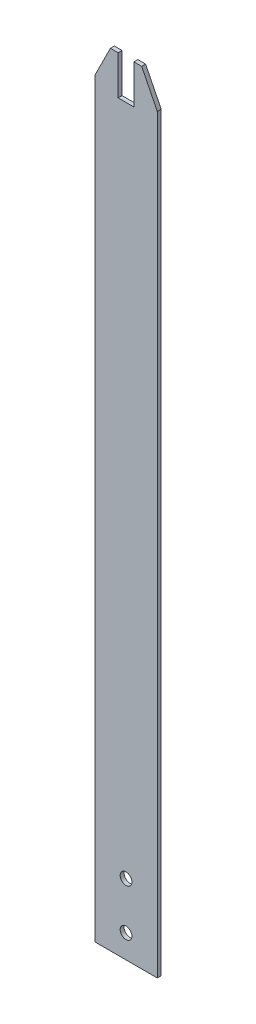
ISO-10303-21;
HEADER;
FILE_DESCRIPTION(('STEP AP214'),'2;1');
FILE_NAME('part.step','',(''),(''),'','','');
FILE_SCHEMA(('AUTOMOTIVE_DESIGN { 1 0 10303 214 1 1 1 1 }'));
ENDSEC;
DATA;
#1=APPLICATION_CONTEXT('core data for automotive mechanical design processes');
#2=APPLICATION_PROTOCOL_DEFINITION('international standard','automotive_design',2000,#1);
#3=PRODUCT_CONTEXT('',#1,'mechanical');
#4=PRODUCT('Part','Part','',(#3));
#5=PRODUCT_RELATED_PRODUCT_CATEGORY('part','',(#4));
#6=PRODUCT_DEFINITION_FORMATION('','',#4);
#7=PRODUCT_DEFINITION_CONTEXT('part definition',#1,'design');
#8=PRODUCT_DEFINITION('design','',#6,#7);
#9=PRODUCT_DEFINITION_SHAPE('','',#8);
#10=(LENGTH_UNIT() NAMED_UNIT(*) SI_UNIT(.MILLI.,.METRE.));
#11=(NAMED_UNIT(*) PLANE_ANGLE_UNIT() SI_UNIT($,.RADIAN.));
#12=(NAMED_UNIT(*) SI_UNIT($,.STERADIAN.) SOLID_ANGLE_UNIT());
#13=UNCERTAINTY_MEASURE_WITH_UNIT(LENGTH_MEASURE(1.E-05),#10,'distance_accuracy_value','');
#14=(GEOMETRIC_REPRESENTATION_CONTEXT(3) GLOBAL_UNCERTAINTY_ASSIGNED_CONTEXT((#13)) GLOBAL_UNIT_ASSIGNED_CONTEXT((#10,
#11,#12)) REPRESENTATION_CONTEXT('',''));
#15=CARTESIAN_POINT('',(0.,0.,0.));
#16=DIRECTION('',(0.,0.,1.));
#17=DIRECTION('',(1.,0.,0.));
#18=AXIS2_PLACEMENT_3D('',#15,#16,#17);
#19=CARTESIAN_POINT('',(1.15525786010828E-13,-1000.,2.5));
#20=DIRECTION('',(0.,0.,-1.));
#21=DIRECTION('',(-1.,0.,0.));
#22=AXIS2_PLACEMENT_3D('',#19,#20,#21);
#23=PLANE('',#22);
#24=CARTESIAN_POINT('',(-39.9999999999999,-970.,2.5));
#25=DIRECTION('',(0.,0.,1.));
#26=DIRECTION('',(1.,0.,0.));
#27=AXIS2_PLACEMENT_3D('',#24,#25,#26);
#28=CIRCLE('',#27,7.5);
#29=CARTESIAN_POINT('',(-32.4999999999999,-970.,2.5));
#30=VERTEX_POINT('',#29);
#31=EDGE_CURVE('E157',#30,#30,#28,.T.);
#32=ORIENTED_EDGE('',*,*,#31,.F.);
#33=EDGE_LOOP('',(#32));
#34=FACE_BOUND('',#33,.T.);
#35=CARTESIAN_POINT('',(-39.9999999999999,-910.,2.5));
#36=DIRECTION('',(0.,0.,1.));
#37=DIRECTION('',(1.,0.,0.));
#38=AXIS2_PLACEMENT_3D('',#35,#36,#37);
#39=CIRCLE('',#38,7.5);
#40=CARTESIAN_POINT('',(-32.4999999999999,-910.,2.5));
#41=VERTEX_POINT('',#40);
#42=EDGE_CURVE('E169',#41,#41,#39,.T.);
#43=ORIENTED_EDGE('',*,*,#42,.F.);
#44=EDGE_LOOP('',(#43));
#45=FACE_BOUND('',#44,.T.);
#46=DIRECTION('',(-0.447213595499958,-0.894427190999916,0.));
#47=VECTOR('',#46,1.);
#48=CARTESIAN_POINT('',(-48.,24.,2.5));
#49=LINE('',#48,#47);
#50=CARTESIAN_POINT('',(-60.,0.,2.49999999999979));
#51=VERTEX_POINT('',#50);
#52=CARTESIAN_POINT('',(-80.,-40.,2.5));
#53=VERTEX_POINT('',#52);
#54=EDGE_CURVE('E51',#51,#53,#49,.T.);
#55=ORIENTED_EDGE('',*,*,#54,.T.);
#56=DIRECTION('',(0.,1.,0.));
#57=VECTOR('',#56,1.);
#58=CARTESIAN_POINT('',(-79.9999999999999,-1000.,2.49999999999972));
#59=LINE('',#58,#57);
#60=CARTESIAN_POINT('',(-79.9999999999999,-1000.,2.49999999999972));
#61=VERTEX_POINT('',#60);
#62=EDGE_CURVE('E123',#61,#53,#59,.T.);
#63=ORIENTED_EDGE('',*,*,#62,.F.);
#64=DIRECTION('',(-1.,0.,0.));
#65=VECTOR('',#64,1.);
#66=CARTESIAN_POINT('',(1.15525786010828E-13,-1000.,2.5));
#67=LINE('',#66,#65);
#68=CARTESIAN_POINT('',(1.15525786010828E-13,-1000.,2.5));
#69=VERTEX_POINT('',#68);
#70=EDGE_CURVE('E178',#69,#61,#67,.T.);
#71=ORIENTED_EDGE('',*,*,#70,.F.);
#72=DIRECTION('',(0.,1.,0.));
#73=VECTOR('',#72,1.);
#74=CARTESIAN_POINT('',(1.15525786010828E-13,-1000.,2.5));
#75=LINE('',#74,#73);
#76=CARTESIAN_POINT('',(-1.26689023854931E-13,-40.,2.5));
#77=VERTEX_POINT('',#76);
#78=EDGE_CURVE('E132',#69,#77,#75,.T.);
#79=ORIENTED_EDGE('',*,*,#78,.T.);
#80=DIRECTION('',(0.447213595499956,-0.894427190999917,0.));
#81=VECTOR('',#80,1.);
#82=CARTESIAN_POINT('',(-20.,0.,2.5));
#83=LINE('',#82,#81);
#84=CARTESIAN_POINT('',(-20.,0.,2.5));
#85=VERTEX_POINT('',#84);
#86=EDGE_CURVE('E198',#85,#77,#83,.T.);
#87=ORIENTED_EDGE('',*,*,#86,.F.);
#88=DIRECTION('',(-1.,0.,0.));
#89=VECTOR('',#88,1.);
#90=CARTESIAN_POINT('',(0.,0.,2.5));
#91=LINE('',#90,#89);
#92=CARTESIAN_POINT('',(-29.9,0.,2.5));
#93=VERTEX_POINT('',#92);
#94=EDGE_CURVE('E184',#85,#93,#91,.T.);
#95=ORIENTED_EDGE('',*,*,#94,.T.);
#96=DIRECTION('',(0.,-1.,0.));
#97=VECTOR('',#96,1.);
#98=CARTESIAN_POINT('',(-29.9,0.,2.5));
#99=LINE('',#98,#97);
#100=CARTESIAN_POINT('',(-29.9,-50.,2.5));
#101=VERTEX_POINT('',#100);
#102=EDGE_CURVE('E128',#93,#101,#99,.T.);
#103=ORIENTED_EDGE('',*,*,#102,.T.);
#104=DIRECTION('',(1.,0.,0.));
#105=VECTOR('',#104,1.);
#106=CARTESIAN_POINT('',(-50.1,-50.,2.5));
#107=LINE('',#106,#105);
#108=CARTESIAN_POINT('',(-50.1,-50.,2.5));
#109=VERTEX_POINT('',#108);
#110=EDGE_CURVE('E204',#109,#101,#107,.T.);
#111=ORIENTED_EDGE('',*,*,#110,.F.);
#112=DIRECTION('',(0.,1.,0.));
#113=VECTOR('',#112,1.);
#114=CARTESIAN_POINT('',(-50.1,-50.,2.5));
#115=LINE('',#114,#113);
#116=CARTESIAN_POINT('',(-50.1,0.,2.5));
#117=VERTEX_POINT('',#116);
#118=EDGE_CURVE('E207',#109,#117,#115,.T.);
#119=ORIENTED_EDGE('',*,*,#118,.T.);
#120=EDGE_CURVE('E127',#117,#51,#91,.T.);
#121=ORIENTED_EDGE('',*,*,#120,.T.);
#122=EDGE_LOOP('',(#55,#63,#71,#79,#87,#95,#103,#111,#119,#121));
#123=FACE_BOUND('',#122,.T.);
#124=ADVANCED_FACE('F36',(#34,#45,#123),#23,.F.);
#125=CARTESIAN_POINT('',(-79.9999999999999,-1000.,-2.50000000000028));
#126=DIRECTION('',(1.,0.,0.));
#127=DIRECTION('',(0.,0.,-1.));
#128=AXIS2_PLACEMENT_3D('',#125,#126,#127);
#129=PLANE('',#128);
#130=DIRECTION('',(0.,0.,1.));
#131=VECTOR('',#130,1.);
#132=CARTESIAN_POINT('',(-80.,-40.,-20.0000000000002));
#133=LINE('',#132,#131);
#134=CARTESIAN_POINT('',(-80.,-40.,-2.50000000000028));
#135=VERTEX_POINT('',#134);
#136=EDGE_CURVE('E111',#135,#53,#133,.T.);
#137=ORIENTED_EDGE('',*,*,#136,.F.);
#138=DIRECTION('',(0.,1.,0.));
#139=VECTOR('',#138,1.);
#140=CARTESIAN_POINT('',(-79.9999999999999,-1000.,-2.50000000000028));
#141=LINE('',#140,#139);
#142=CARTESIAN_POINT('',(-79.9999999999999,-1000.,-2.50000000000028));
#143=VERTEX_POINT('',#142);
#144=EDGE_CURVE('E133',#143,#135,#141,.T.);
#145=ORIENTED_EDGE('',*,*,#144,.F.);
#146=DIRECTION('',(0.,0.,-1.));
#147=VECTOR('',#146,1.);
#148=CARTESIAN_POINT('',(-79.9999999999999,-1000.,-2.50000000000028));
#149=LINE('',#148,#147);
#150=EDGE_CURVE('E131',#61,#143,#149,.T.);
#151=ORIENTED_EDGE('',*,*,#150,.F.);
#152=ORIENTED_EDGE('',*,*,#62,.T.);
#153=EDGE_LOOP('',(#137,#145,#151,#152));
#154=FACE_BOUND('',#153,.T.);
#155=ADVANCED_FACE('F130',(#154),#129,.F.);
#156=CARTESIAN_POINT('',(1.29403573818643E-13,-1000.,-2.5));
#157=DIRECTION('',(0.,0.,1.));
#158=DIRECTION('',(1.,0.,0.));
#159=AXIS2_PLACEMENT_3D('',#156,#157,#158);
#160=PLANE('',#159);
#161=CARTESIAN_POINT('',(-39.9999999999999,-970.,-2.50000000000028));
#162=DIRECTION('',(0.,0.,1.));
#163=DIRECTION('',(1.,0.,0.));
#164=AXIS2_PLACEMENT_3D('',#161,#162,#163);
#165=CIRCLE('',#164,7.5);
#166=CARTESIAN_POINT('',(-32.4999999999999,-970.,-2.50000000000028));
#167=VERTEX_POINT('',#166);
#168=EDGE_CURVE('E161',#167,#167,#165,.T.);
#169=ORIENTED_EDGE('',*,*,#168,.T.);
#170=EDGE_LOOP('',(#169));
#171=FACE_BOUND('',#170,.T.);
#172=CARTESIAN_POINT('',(-39.9999999999999,-910.,-2.50000000000028));
#173=DIRECTION('',(0.,0.,1.));
#174=DIRECTION('',(1.,0.,0.));
#175=AXIS2_PLACEMENT_3D('',#172,#173,#174);
#176=CIRCLE('',#175,7.5);
#177=CARTESIAN_POINT('',(-32.4999999999999,-910.,-2.50000000000028));
#178=VERTEX_POINT('',#177);
#179=EDGE_CURVE('E172',#178,#178,#176,.T.);
#180=ORIENTED_EDGE('',*,*,#179,.T.);
#181=EDGE_LOOP('',(#180));
#182=FACE_BOUND('',#181,.T.);
#183=DIRECTION('',(-0.447213595499958,-0.894427190999916,0.));
#184=VECTOR('',#183,1.);
#185=CARTESIAN_POINT('',(-448.,-776.,-2.50000000000156));
#186=LINE('',#185,#184);
#187=CARTESIAN_POINT('',(-60.,0.,-2.50000000000028));
#188=VERTEX_POINT('',#187);
#189=EDGE_CURVE('E114',#188,#135,#186,.T.);
#190=ORIENTED_EDGE('',*,*,#189,.F.);
#191=DIRECTION('',(1.,0.,0.));
#192=VECTOR('',#191,1.);
#193=CARTESIAN_POINT('',(0.,0.,-2.5));
#194=LINE('',#193,#192);
#195=CARTESIAN_POINT('',(-50.1,0.,-2.50000000000017));
#196=VERTEX_POINT('',#195);
#197=EDGE_CURVE('E152',#188,#196,#194,.T.);
#198=ORIENTED_EDGE('',*,*,#197,.T.);
#199=DIRECTION('',(0.,1.,0.));
#200=VECTOR('',#199,1.);
#201=CARTESIAN_POINT('',(-50.1,-1000.,-2.50000000000017));
#202=LINE('',#201,#200);
#203=CARTESIAN_POINT('',(-50.1,-50.,-2.50000000000017));
#204=VERTEX_POINT('',#203);
#205=EDGE_CURVE('E163',#204,#196,#202,.T.);
#206=ORIENTED_EDGE('',*,*,#205,.F.);
#207=DIRECTION('',(1.,0.,0.));
#208=VECTOR('',#207,1.);
#209=CARTESIAN_POINT('',(1.29403573818643E-13,-50.,-2.5));
#210=LINE('',#209,#208);
#211=CARTESIAN_POINT('',(-29.9,-50.,-2.50000000000014));
#212=VERTEX_POINT('',#211);
#213=EDGE_CURVE('E11',#204,#212,#210,.T.);
#214=ORIENTED_EDGE('',*,*,#213,.T.);
#215=DIRECTION('',(0.,-1.,0.));
#216=VECTOR('',#215,1.);
#217=CARTESIAN_POINT('',(-29.8999999999999,-1000.,-2.5000000000001));
#218=LINE('',#217,#216);
#219=CARTESIAN_POINT('',(-29.9,0.,-2.50000000000028));
#220=VERTEX_POINT('',#219);
#221=EDGE_CURVE('E158',#220,#212,#218,.T.);
#222=ORIENTED_EDGE('',*,*,#221,.F.);
#223=CARTESIAN_POINT('',(-20.,0.,-2.50000000000007));
#224=VERTEX_POINT('',#223);
#225=EDGE_CURVE('E185',#220,#224,#194,.T.);
#226=ORIENTED_EDGE('',*,*,#225,.T.);
#227=DIRECTION('',(0.447213595499955,-0.894427190999917,0.));
#228=VECTOR('',#227,1.);
#229=CARTESIAN_POINT('',(383.999999999998,-808.000000000002,-2.49999999999866));
#230=LINE('',#229,#228);
#231=CARTESIAN_POINT('',(-1.26689023854931E-13,-40.,-2.50000000000003));
#232=VERTEX_POINT('',#231);
#233=EDGE_CURVE('E59',#224,#232,#230,.T.);
#234=ORIENTED_EDGE('',*,*,#233,.T.);
#235=DIRECTION('',(0.,1.,0.));
#236=VECTOR('',#235,1.);
#237=CARTESIAN_POINT('',(1.29403573818643E-13,-1000.,-2.5));
#238=LINE('',#237,#236);
#239=CARTESIAN_POINT('',(1.29403573818643E-13,-1000.,-2.5));
#240=VERTEX_POINT('',#239);
#241=EDGE_CURVE('E138',#240,#232,#238,.T.);
#242=ORIENTED_EDGE('',*,*,#241,.F.);
#243=DIRECTION('',(1.,0.,0.));
#244=VECTOR('',#243,1.);
#245=CARTESIAN_POINT('',(1.29403573818643E-13,-1000.,-2.5));
#246=LINE('',#245,#244);
#247=EDGE_CURVE('E181',#143,#240,#246,.T.);
#248=ORIENTED_EDGE('',*,*,#247,.F.);
#249=ORIENTED_EDGE('',*,*,#144,.T.);
#250=EDGE_LOOP('',(#190,#198,#206,#214,#222,#226,#234,#242,#248,#249));
#251=FACE_BOUND('',#250,.T.);
#252=ADVANCED_FACE('F154',(#171,#182,#251),#160,.F.);
#253=CARTESIAN_POINT('',(-40.,0.,-1.38777878078145E-13));
#254=DIRECTION('',(0.,1.,0.));
#255=DIRECTION('',(-1.,0.,0.));
#256=AXIS2_PLACEMENT_3D('',#253,#254,#255);
#257=PLANE('',#256);
#258=ORIENTED_EDGE('',*,*,#197,.F.);
#259=DIRECTION('',(0.,0.,1.));
#260=VECTOR('',#259,1.);
#261=CARTESIAN_POINT('',(-60.,0.,-1.38777878078145E-13));
#262=LINE('',#261,#260);
#263=EDGE_CURVE('E44',#188,#51,#262,.T.);
#264=ORIENTED_EDGE('',*,*,#263,.T.);
#265=ORIENTED_EDGE('',*,*,#120,.F.);
#266=DIRECTION('',(0.,0.,-1.));
#267=VECTOR('',#266,1.);
#268=CARTESIAN_POINT('',(-50.1,0.,-1.38777878078145E-13));
#269=LINE('',#268,#267);
#270=EDGE_CURVE('E143',#117,#196,#269,.T.);
#271=ORIENTED_EDGE('',*,*,#270,.T.);
#272=EDGE_LOOP('',(#258,#264,#265,#271));
#273=FACE_BOUND('',#272,.T.);
#274=ADVANCED_FACE('F150',(#273),#257,.T.);
#275=ORIENTED_EDGE('',*,*,#225,.F.);
#276=DIRECTION('',(0.,0.,1.));
#277=VECTOR('',#276,1.);
#278=CARTESIAN_POINT('',(-29.9,0.,-1.38777878078145E-13));
#279=LINE('',#278,#277);
#280=EDGE_CURVE('E146',#220,#93,#279,.T.);
#281=ORIENTED_EDGE('',*,*,#280,.T.);
#282=ORIENTED_EDGE('',*,*,#94,.F.);
#283=DIRECTION('',(0.,0.,1.));
#284=VECTOR('',#283,1.);
#285=CARTESIAN_POINT('',(-20.,0.,-1.38777878078145E-13));
#286=LINE('',#285,#284);
#287=EDGE_CURVE('E136',#224,#85,#286,.T.);
#288=ORIENTED_EDGE('',*,*,#287,.F.);
#289=EDGE_LOOP('',(#275,#281,#282,#288));
#290=FACE_BOUND('',#289,.T.);
#291=ADVANCED_FACE('F223',(#290),#257,.T.);
#292=CARTESIAN_POINT('',(1.15525786010828E-13,-1000.,2.5));
#293=DIRECTION('',(-1.,0.,0.));
#294=DIRECTION('',(0.,0.,1.));
#295=AXIS2_PLACEMENT_3D('',#292,#293,#294);
#296=PLANE('',#295);
#297=ORIENTED_EDGE('',*,*,#241,.T.);
#298=DIRECTION('',(0.,0.,1.));
#299=VECTOR('',#298,1.);
#300=CARTESIAN_POINT('',(-1.26689023854931E-13,-40.,-20.0000000000002));
#301=LINE('',#300,#299);
#302=EDGE_CURVE('E193',#232,#77,#301,.T.);
#303=ORIENTED_EDGE('',*,*,#302,.T.);
#304=ORIENTED_EDGE('',*,*,#78,.F.);
#305=DIRECTION('',(0.,0.,1.));
#306=VECTOR('',#305,1.);
#307=CARTESIAN_POINT('',(1.15525786010828E-13,-1000.,2.5));
#308=LINE('',#307,#306);
#309=EDGE_CURVE('E175',#240,#69,#308,.T.);
#310=ORIENTED_EDGE('',*,*,#309,.F.);
#311=EDGE_LOOP('',(#297,#303,#304,#310));
#312=FACE_BOUND('',#311,.T.);
#313=ADVANCED_FACE('F38',(#312),#296,.F.);
#314=CARTESIAN_POINT('',(-39.9999999999999,-1000.,-1.38777878078145E-13));
#315=DIRECTION('',(0.,1.,0.));
#316=DIRECTION('',(-1.,0.,0.));
#317=AXIS2_PLACEMENT_3D('',#314,#315,#316);
#318=PLANE('',#317);
#319=ORIENTED_EDGE('',*,*,#309,.T.);
#320=ORIENTED_EDGE('',*,*,#70,.T.);
#321=ORIENTED_EDGE('',*,*,#150,.T.);
#322=ORIENTED_EDGE('',*,*,#247,.T.);
#323=EDGE_LOOP('',(#319,#320,#321,#322));
#324=FACE_BOUND('',#323,.T.);
#325=ADVANCED_FACE('F250',(#324),#318,.F.);
#326=CARTESIAN_POINT('',(-39.9999999999999,-910.,2.5));
#327=DIRECTION('',(0.,0.,1.));
#328=DIRECTION('',(1.,0.,0.));
#329=AXIS2_PLACEMENT_3D('',#326,#327,#328);
#330=CYLINDRICAL_SURFACE('',#329,7.5);
#331=ORIENTED_EDGE('',*,*,#179,.F.);
#332=EDGE_LOOP('',(#331));
#333=FACE_BOUND('',#332,.T.);
#334=ORIENTED_EDGE('',*,*,#42,.T.);
#335=EDGE_LOOP('',(#334));
#336=FACE_BOUND('',#335,.T.);
#337=ADVANCED_FACE('F253',(#333,#336),#330,.F.);
#338=CARTESIAN_POINT('',(-39.9999999999999,-970.,2.5));
#339=DIRECTION('',(0.,0.,1.));
#340=DIRECTION('',(1.,0.,0.));
#341=AXIS2_PLACEMENT_3D('',#338,#339,#340);
#342=CYLINDRICAL_SURFACE('',#341,7.5);
#343=ORIENTED_EDGE('',*,*,#168,.F.);
#344=EDGE_LOOP('',(#343));
#345=FACE_BOUND('',#344,.T.);
#346=ORIENTED_EDGE('',*,*,#31,.T.);
#347=EDGE_LOOP('',(#346));
#348=FACE_BOUND('',#347,.T.);
#349=ADVANCED_FACE('F257',(#345,#348),#342,.F.);
#350=CARTESIAN_POINT('',(-20.,0.,-20.0000000000002));
#351=DIRECTION('',(-0.894427190999917,-0.447213595499955,0.));
#352=DIRECTION('',(0.447213595499955,-0.894427190999917,0.));
#353=AXIS2_PLACEMENT_3D('',#350,#351,#352);
#354=PLANE('',#353);
#355=ORIENTED_EDGE('',*,*,#287,.T.);
#356=ORIENTED_EDGE('',*,*,#86,.T.);
#357=ORIENTED_EDGE('',*,*,#302,.F.);
#358=ORIENTED_EDGE('',*,*,#233,.F.);
#359=EDGE_LOOP('',(#355,#356,#357,#358));
#360=FACE_BOUND('',#359,.T.);
#361=ADVANCED_FACE('F260',(#360),#354,.F.);
#362=CARTESIAN_POINT('',(-50.1,-50.,-20.0000000000002));
#363=DIRECTION('',(0.,-1.,0.));
#364=DIRECTION('',(0.,0.,-1.));
#365=AXIS2_PLACEMENT_3D('',#362,#363,#364);
#366=PLANE('',#365);
#367=DIRECTION('',(0.,0.,1.));
#368=VECTOR('',#367,1.);
#369=CARTESIAN_POINT('',(-50.1,-50.,-20.0000000000002));
#370=LINE('',#369,#368);
#371=EDGE_CURVE('E209',#204,#109,#370,.T.);
#372=ORIENTED_EDGE('',*,*,#371,.T.);
#373=ORIENTED_EDGE('',*,*,#110,.T.);
#374=DIRECTION('',(0.,0.,1.));
#375=VECTOR('',#374,1.);
#376=CARTESIAN_POINT('',(-29.9,-50.,-20.0000000000002));
#377=LINE('',#376,#375);
#378=EDGE_CURVE('E200',#212,#101,#377,.T.);
#379=ORIENTED_EDGE('',*,*,#378,.F.);
#380=ORIENTED_EDGE('',*,*,#213,.F.);
#381=EDGE_LOOP('',(#372,#373,#379,#380));
#382=FACE_BOUND('',#381,.T.);
#383=ADVANCED_FACE('F216',(#382),#366,.F.);
#384=CARTESIAN_POINT('',(-29.9,0.,-20.0000000000002));
#385=DIRECTION('',(-1.,0.,0.));
#386=DIRECTION('',(0.,-1.,0.));
#387=AXIS2_PLACEMENT_3D('',#384,#385,#386);
#388=PLANE('',#387);
#389=ORIENTED_EDGE('',*,*,#221,.T.);
#390=ORIENTED_EDGE('',*,*,#378,.T.);
#391=ORIENTED_EDGE('',*,*,#102,.F.);
#392=ORIENTED_EDGE('',*,*,#280,.F.);
#393=EDGE_LOOP('',(#389,#390,#391,#392));
#394=FACE_BOUND('',#393,.T.);
#395=ADVANCED_FACE('F213',(#394),#388,.T.);
#396=CARTESIAN_POINT('',(-50.1,-50.,-20.0000000000002));
#397=DIRECTION('',(1.,0.,0.));
#398=DIRECTION('',(0.,0.,-1.));
#399=AXIS2_PLACEMENT_3D('',#396,#397,#398);
#400=PLANE('',#399);
#401=ORIENTED_EDGE('',*,*,#205,.T.);
#402=ORIENTED_EDGE('',*,*,#270,.F.);
#403=ORIENTED_EDGE('',*,*,#118,.F.);
#404=ORIENTED_EDGE('',*,*,#371,.F.);
#405=EDGE_LOOP('',(#401,#402,#403,#404));
#406=FACE_BOUND('',#405,.T.);
#407=ADVANCED_FACE('F225',(#406),#400,.T.);
#408=CARTESIAN_POINT('',(-48.,24.,-20.0000000000002));
#409=DIRECTION('',(-0.894427190999916,0.447213595499958,0.));
#410=DIRECTION('',(-0.447213595499958,-0.894427190999916,0.));
#411=AXIS2_PLACEMENT_3D('',#408,#409,#410);
#412=PLANE('',#411);
#413=ORIENTED_EDGE('',*,*,#189,.T.);
#414=ORIENTED_EDGE('',*,*,#136,.T.);
#415=ORIENTED_EDGE('',*,*,#54,.F.);
#416=ORIENTED_EDGE('',*,*,#263,.F.);
#417=EDGE_LOOP('',(#413,#414,#415,#416));
#418=FACE_BOUND('',#417,.T.);
#419=ADVANCED_FACE('F112',(#418),#412,.T.);
#420=CLOSED_SHELL('',(#124,#155,#252,#274,#291,#313,#325,#337,#349,#361,#383,#395,#407,#419));
#421=MANIFOLD_SOLID_BREP('B2',#420);
#422=ADVANCED_BREP_SHAPE_REPRESENTATION('',(#18,#421),#14);
#423=SHAPE_DEFINITION_REPRESENTATION(#9,#422);
ENDSEC;
END-ISO-10303-21;
